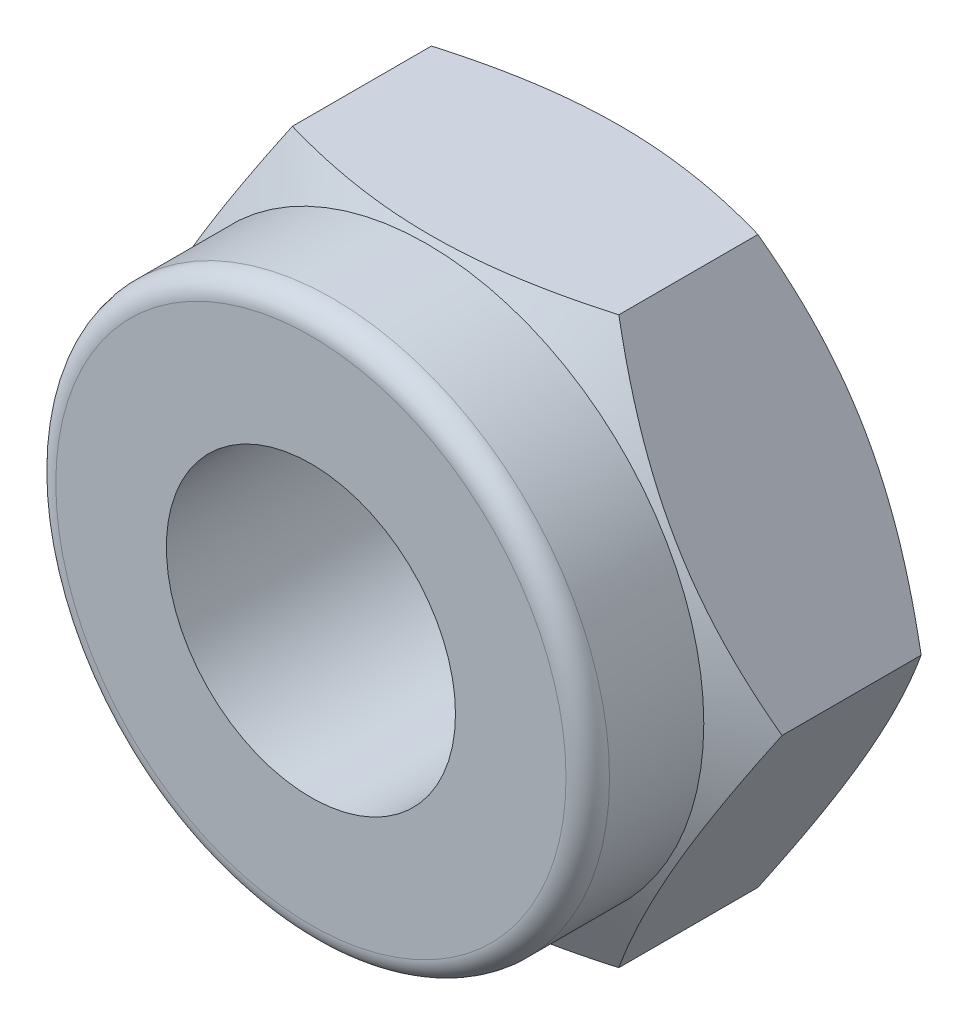
ISO-10303-21;
HEADER;
FILE_DESCRIPTION(('STEP AP214'),'2;1');
FILE_NAME('part.step','',(''),(''),'','','');
FILE_SCHEMA(('AUTOMOTIVE_DESIGN { 1 0 10303 214 1 1 1 1 }'));
ENDSEC;
DATA;
#1=APPLICATION_CONTEXT('core data for automotive mechanical design processes');
#2=APPLICATION_PROTOCOL_DEFINITION('international standard','automotive_design',2000,#1);
#3=PRODUCT_CONTEXT('',#1,'mechanical');
#4=PRODUCT('Part','Part','',(#3));
#5=PRODUCT_RELATED_PRODUCT_CATEGORY('part','',(#4));
#6=PRODUCT_DEFINITION_FORMATION('','',#4);
#7=PRODUCT_DEFINITION_CONTEXT('part definition',#1,'design');
#8=PRODUCT_DEFINITION('design','',#6,#7);
#9=PRODUCT_DEFINITION_SHAPE('','',#8);
#10=(LENGTH_UNIT() NAMED_UNIT(*) SI_UNIT(.MILLI.,.METRE.));
#11=(NAMED_UNIT(*) PLANE_ANGLE_UNIT() SI_UNIT($,.RADIAN.));
#12=(NAMED_UNIT(*) SI_UNIT($,.STERADIAN.) SOLID_ANGLE_UNIT());
#13=UNCERTAINTY_MEASURE_WITH_UNIT(LENGTH_MEASURE(1.E-05),#10,'distance_accuracy_value','');
#14=(GEOMETRIC_REPRESENTATION_CONTEXT(3) GLOBAL_UNCERTAINTY_ASSIGNED_CONTEXT((#13)) GLOBAL_UNIT_ASSIGNED_CONTEXT((#10,
#11,#12)) REPRESENTATION_CONTEXT('',''));
#15=CARTESIAN_POINT('',(0.,0.,0.));
#16=DIRECTION('',(0.,0.,1.));
#17=DIRECTION('',(1.,0.,0.));
#18=AXIS2_PLACEMENT_3D('',#15,#16,#17);
#19=CARTESIAN_POINT('',(0.,0.,4.35));
#20=DIRECTION('',(0.,0.,-1.));
#21=DIRECTION('',(-1.,0.,0.));
#22=AXIS2_PLACEMENT_3D('',#19,#20,#21);
#23=CYLINDRICAL_SURFACE('',#22,6.365);
#24=CARTESIAN_POINT('',(0.,0.,1.85));
#25=DIRECTION('',(0.,0.,1.));
#26=DIRECTION('',(1.,0.,0.));
#27=AXIS2_PLACEMENT_3D('',#24,#25,#26);
#28=CIRCLE('',#27,6.365);
#29=CARTESIAN_POINT('',(6.365,0.,1.85));
#30=VERTEX_POINT('',#29);
#31=EDGE_CURVE('E184',#30,#30,#28,.T.);
#32=ORIENTED_EDGE('',*,*,#31,.F.);
#33=EDGE_LOOP('',(#32));
#34=FACE_BOUND('',#33,.T.);
#35=CARTESIAN_POINT('',(0.,0.,-0.317542648054294));
#36=DIRECTION('',(0.,0.,-1.));
#37=DIRECTION('',(1.,0.,0.));
#38=AXIS2_PLACEMENT_3D('',#35,#36,#37);
#39=CIRCLE('',#38,6.365);
#40=CARTESIAN_POINT('',(6.365,0.,-0.317542648054294));
#41=VERTEX_POINT('',#40);
#42=EDGE_CURVE('E187',#41,#41,#39,.T.);
#43=ORIENTED_EDGE('',*,*,#42,.F.);
#44=EDGE_LOOP('',(#43));
#45=FACE_BOUND('',#44,.T.);
#46=ADVANCED_FACE('F16',(#34,#45),#23,.T.);
#47=CARTESIAN_POINT('',(0.,0.,1.85));
#48=DIRECTION('',(0.,0.,1.));
#49=DIRECTION('',(1.,0.,0.));
#50=AXIS2_PLACEMENT_3D('',#47,#48,#49);
#51=TOROIDAL_SURFACE('',#50,5.865,0.5);
#52=ORIENTED_EDGE('',*,*,#31,.T.);
#53=EDGE_LOOP('',(#52));
#54=FACE_BOUND('',#53,.T.);
#55=CARTESIAN_POINT('',(0.,0.,2.35));
#56=DIRECTION('',(0.,0.,-1.));
#57=DIRECTION('',(1.,0.,0.));
#58=AXIS2_PLACEMENT_3D('',#55,#56,#57);
#59=CIRCLE('',#58,5.865);
#60=CARTESIAN_POINT('',(-5.865,0.,2.35));
#61=VERTEX_POINT('',#60);
#62=CARTESIAN_POINT('',(5.865,0.,2.35));
#63=VERTEX_POINT('',#62);
#64=EDGE_CURVE('E74',#61,#63,#59,.F.);
#65=ORIENTED_EDGE('',*,*,#64,.F.);
#66=CARTESIAN_POINT('',(0.,0.,2.35));
#67=DIRECTION('',(0.,0.,-1.));
#68=DIRECTION('',(-1.,0.,0.));
#69=AXIS2_PLACEMENT_3D('',#66,#67,#68);
#70=CIRCLE('',#69,5.865);
#71=EDGE_CURVE('E190',#63,#61,#70,.F.);
#72=ORIENTED_EDGE('',*,*,#71,.F.);
#73=EDGE_LOOP('',(#65,#72));
#74=FACE_BOUND('',#73,.T.);
#75=ADVANCED_FACE('F107',(#54,#74),#51,.T.);
#76=CARTESIAN_POINT('',(0.,0.,-0.97999251121531));
#77=DIRECTION('',(0.,0.,-1.));
#78=DIRECTION('',(-1.,0.,0.));
#79=AXIS2_PLACEMENT_3D('',#76,#77,#78);
#80=CONICAL_SURFACE('',#79,7.51239682046193,1.0471975511966);
#81=CARTESIAN_POINT('',(7.50555349946514,0.,-0.976041517995662));
#82=CARTESIAN_POINT('',(7.42306413225731,-0.142875775088176,-0.928425447547227));
#83=CARTESIAN_POINT('',(7.34026720585395,-0.286284258329331,-0.882970550055043));
#84=CARTESIAN_POINT('',(7.17400096468323,-0.574265835620523,-0.796978304075957));
#85=CARTESIAN_POINT('',(7.09053137629194,-0.718839403601101,-0.756443076940983));
#86=CARTESIAN_POINT('',(6.83878625276799,-1.15487474810228,-0.643012619628592));
#87=CARTESIAN_POINT('',(6.66951702604567,-1.44805764894324,-0.578495682867198));
#88=CARTESIAN_POINT('',(6.41620872846852,-1.88680049032564,-0.502843782974544));
#89=CARTESIAN_POINT('',(6.33292644227507,-2.03104964138317,-0.48129310542054));
#90=CARTESIAN_POINT('',(6.16598561364301,-2.32019963843156,-0.445156633633839));
#91=CARTESIAN_POINT('',(6.08232710510691,-2.46510042570152,-0.430570224040223));
#92=CARTESIAN_POINT('',(5.91486483881928,-2.75515357926232,-0.408734025939752));
#93=CARTESIAN_POINT('',(5.83106135447214,-2.90030547200287,-0.401475912268133));
#94=CARTESIAN_POINT('',(5.66338165892069,-3.19073522409566,-0.394444145267347));
#95=CARTESIAN_POINT('',(5.57950545004408,-3.33601307941621,-0.394670260634795));
#96=CARTESIAN_POINT('',(5.34972638911939,-3.73400208745323,-0.405576488157031));
#97=CARTESIAN_POINT('',(5.20389879784904,-3.98658288467888,-0.423875958247116));
#98=CARTESIAN_POINT('',(4.91321216353889,-4.49006690438526,-0.481897477157326));
#99=CARTESIAN_POINT('',(4.76835414237743,-4.74096835692078,-0.521639346886367));
#100=CARTESIAN_POINT('',(4.47708276744823,-5.24546517708861,-0.620980029139186));
#101=CARTESIAN_POINT('',(4.33070615631823,-5.49899690460551,-0.680999630839513));
#102=CARTESIAN_POINT('',(4.04013550251678,-6.00228004017814,-0.817218966611441));
#103=CARTESIAN_POINT('',(3.89593774018532,-6.25203789087397,-0.893386714735364));
#104=CARTESIAN_POINT('',(3.75277674973258,-6.5,-0.976041517995661));
#105=B_SPLINE_CURVE_WITH_KNOTS('',3,(#81,#82,#83,#84,#85,#86,#87,#88,#89,#90,#91,#92,#93,#94,
#95,#96,#97,#98,#99,#100,#101,#102,#103,#104),.UNSPECIFIED.,.F.,.F.,(4,2,2,2,2,2,2,2,2,2,2,4),
(0.,0.515097151807923,1.03041562924707,2.0631934970254,2.56693469263121,3.07063136955385,
3.57375518587235,4.07686345294286,4.95263085757859,5.82920919385675,6.72522583711309,
7.61948397794854),.UNSPECIFIED.);
#106=CARTESIAN_POINT('',(7.50555349946513,0.,-0.976041517995657));
#107=VERTEX_POINT('',#106);
#108=CARTESIAN_POINT('',(3.75277674973258,-6.5,-0.976041517995662));
#109=VERTEX_POINT('',#108);
#110=EDGE_CURVE('E63',#107,#109,#105,.T.);
#111=ORIENTED_EDGE('',*,*,#110,.F.);
#112=CARTESIAN_POINT('',(3.75277674973256,6.5,-0.976041517995656));
#113=CARTESIAN_POINT('',(3.83526611694039,6.35712422491183,-0.928425447547222));
#114=CARTESIAN_POINT('',(3.91806304334374,6.21371574167068,-0.882970550055038));
#115=CARTESIAN_POINT('',(4.08432928451447,5.92573416437948,-0.796978304075951));
#116=CARTESIAN_POINT('',(4.16779887290576,5.78116059639891,-0.756443076940976));
#117=CARTESIAN_POINT('',(4.4195439964297,5.34512525189773,-0.643012619628585));
#118=CARTESIAN_POINT('',(4.58881322315202,5.05194235105677,-0.57849568286719));
#119=CARTESIAN_POINT('',(4.84212152072918,4.61319950967437,-0.502843782974536));
#120=CARTESIAN_POINT('',(4.92540380692262,4.46895035861684,-0.481293105420532));
#121=CARTESIAN_POINT('',(5.09234463555468,4.17980036156845,-0.445156633633831));
#122=CARTESIAN_POINT('',(5.17600314409078,4.03489957429849,-0.430570224040214));
#123=CARTESIAN_POINT('',(5.34346541037841,3.74484642073769,-0.408734025939743));
#124=CARTESIAN_POINT('',(5.42726889472555,3.59969452799714,-0.401475912268124));
#125=CARTESIAN_POINT('',(5.594948590277,3.30926477590435,-0.394444145267338));
#126=CARTESIAN_POINT('',(5.67882479915361,3.16398692058381,-0.394670260634785));
#127=CARTESIAN_POINT('',(5.9086038600783,2.76599791254678,-0.40557648815702));
#128=CARTESIAN_POINT('',(6.05443145134866,2.51341711532113,-0.423875958247104));
#129=CARTESIAN_POINT('',(6.34511808565881,2.00993309561475,-0.481897477157315));
#130=CARTESIAN_POINT('',(6.48997610682026,1.75903164307923,-0.521639346886356));
#131=CARTESIAN_POINT('',(6.78124748174947,1.25453482291139,-0.620980029139175));
#132=CARTESIAN_POINT('',(6.92762409287947,1.00100309539449,-0.680999630839503));
#133=CARTESIAN_POINT('',(7.21819474668093,0.497719959821852,-0.817218966611432));
#134=CARTESIAN_POINT('',(7.36239250901238,0.247962109126026,-0.893386714735356));
#135=CARTESIAN_POINT('',(7.50555349946513,0.,-0.976041517995654));
#136=B_SPLINE_CURVE_WITH_KNOTS('',3,(#112,#113,#114,#115,#116,#117,#118,#119,#120,#121,#122,
#123,#124,#125,#126,#127,#128,#129,#130,#131,#132,#133,#134,#135),.UNSPECIFIED.,.F.,.F.,(4,2,2,
2,2,2,2,2,2,2,2,4),(0.,0.515097151807923,1.03041562924707,2.06319349702539,2.5669346926312,
3.07063136955385,3.57375518587234,4.07686345294285,4.95263085757859,5.82920919385676,
6.72522583711311,7.61948397794856),.UNSPECIFIED.);
#137=CARTESIAN_POINT('',(3.75277674973256,6.5,-0.976041517995657));
#138=VERTEX_POINT('',#137);
#139=EDGE_CURVE('E68',#138,#107,#136,.T.);
#140=ORIENTED_EDGE('',*,*,#139,.F.);
#141=CARTESIAN_POINT('',(-3.75277674973256,6.5,-0.976041517995659));
#142=CARTESIAN_POINT('',(-3.5877980153169,6.5,-0.928425447547224));
#143=CARTESIAN_POINT('',(-3.42220416251019,6.5,-0.882970550055041));
#144=CARTESIAN_POINT('',(-3.08967168016874,6.5,-0.796978304075955));
#145=CARTESIAN_POINT('',(-2.92273250338616,6.5,-0.75644307694098));
#146=CARTESIAN_POINT('',(-2.41924225633827,6.5,-0.64301261962859));
#147=CARTESIAN_POINT('',(-2.08070380289362,6.5,-0.578495682867194));
#148=CARTESIAN_POINT('',(-1.57408720773932,6.5,-0.502843782974541));
#149=CARTESIAN_POINT('',(-1.40752263535244,6.5,-0.481293105420537));
#150=CARTESIAN_POINT('',(-1.07364097808831,6.5,-0.445156633633837));
#151=CARTESIAN_POINT('',(-0.906323961016103,6.5,-0.43057022404022));
#152=CARTESIAN_POINT('',(-0.57139942844085,6.5,-0.408734025939749));
#153=CARTESIAN_POINT('',(-0.40379245974657,6.5,-0.40147591226813));
#154=CARTESIAN_POINT('',(-0.0684330686436741,6.5,-0.394444145267344));
#155=CARTESIAN_POINT('',(0.0993193491095459,6.5,-0.394670260634792));
#156=CARTESIAN_POINT('',(0.558877470958923,6.5,-0.405576488157028));
#157=CARTESIAN_POINT('',(0.850532653499638,6.5,-0.423875958247112));
#158=CARTESIAN_POINT('',(1.43190592211994,6.5,-0.481897477157322));
#159=CARTESIAN_POINT('',(1.72162196444284,6.5,-0.521639346886363));
#160=CARTESIAN_POINT('',(2.30416471430125,6.5,-0.620980029139182));
#161=CARTESIAN_POINT('',(2.59691793656125,6.5,-0.680999630839509));
#162=CARTESIAN_POINT('',(3.17805924416416,6.5,-0.817218966611437));
#163=CARTESIAN_POINT('',(3.46645476882707,6.5,-0.89338671473536));
#164=CARTESIAN_POINT('',(3.75277674973256,6.5,-0.976041517995657));
#165=B_SPLINE_CURVE_WITH_KNOTS('',3,(#141,#142,#143,#144,#145,#146,#147,#148,#149,#150,#151,
#152,#153,#154,#155,#156,#157,#158,#159,#160,#161,#162,#163,#164),.UNSPECIFIED.,.F.,.F.,(4,2,2,
2,2,2,2,2,2,2,2,4),(0.,0.515097151807923,1.03041562924707,2.06319349702539,2.56693469263121,
3.07063136955385,3.57375518587235,4.07686345294286,4.95263085757859,5.82920919385675,
6.72522583711309,7.61948397794854),.UNSPECIFIED.);
#166=CARTESIAN_POINT('',(-3.75277674973256,6.5,-0.976041517995659));
#167=VERTEX_POINT('',#166);
#168=EDGE_CURVE('E86',#167,#138,#165,.T.);
#169=ORIENTED_EDGE('',*,*,#168,.F.);
#170=CARTESIAN_POINT('',(-7.50555349946513,0.,-0.976041517995657));
#171=CARTESIAN_POINT('',(-7.4230641322573,0.14287577508817,-0.928425447547223));
#172=CARTESIAN_POINT('',(-7.34026720585394,0.286284258329325,-0.882970550055039));
#173=CARTESIAN_POINT('',(-7.17400096468322,0.574265835620517,-0.796978304075953));
#174=CARTESIAN_POINT('',(-7.09053137629193,0.718839403601094,-0.756443076940978));
#175=CARTESIAN_POINT('',(-6.83878625276799,1.15487474810227,-0.643012619628588));
#176=CARTESIAN_POINT('',(-6.66951702604566,1.44805764894323,-0.578495682867193));
#177=CARTESIAN_POINT('',(-6.41620872846851,1.88680049032563,-0.502843782974539));
#178=CARTESIAN_POINT('',(-6.33292644227507,2.03104964138316,-0.481293105420536));
#179=CARTESIAN_POINT('',(-6.165985613643,2.32019963843155,-0.445156633633835));
#180=CARTESIAN_POINT('',(-6.0823271051069,2.46510042570151,-0.430570224040218));
#181=CARTESIAN_POINT('',(-5.91486483881928,2.75515357926231,-0.408734025939748));
#182=CARTESIAN_POINT('',(-5.83106135447214,2.90030547200286,-0.401475912268128));
#183=CARTESIAN_POINT('',(-5.66338165892069,3.19073522409565,-0.394444145267342));
#184=CARTESIAN_POINT('',(-5.57950545004408,3.3360130794162,-0.394670260634789));
#185=CARTESIAN_POINT('',(-5.34972638911939,3.73400208745322,-0.405576488157025));
#186=CARTESIAN_POINT('',(-5.20389879784903,3.98658288467887,-0.42387595824711));
#187=CARTESIAN_POINT('',(-4.91321216353888,4.49006690438525,-0.481897477157321));
#188=CARTESIAN_POINT('',(-4.76835414237743,4.74096835692077,-0.521639346886362));
#189=CARTESIAN_POINT('',(-4.47708276744822,5.2454651770886,-0.620980029139181));
#190=CARTESIAN_POINT('',(-4.33070615631822,5.49899690460551,-0.680999630839509));
#191=CARTESIAN_POINT('',(-4.04013550251676,6.00228004017814,-0.817218966611438));
#192=CARTESIAN_POINT('',(-3.89593774018531,6.25203789087397,-0.893386714735362));
#193=CARTESIAN_POINT('',(-3.75277674973256,6.5,-0.976041517995659));
#194=B_SPLINE_CURVE_WITH_KNOTS('',3,(#170,#171,#172,#173,#174,#175,#176,#177,#178,#179,#180,
#181,#182,#183,#184,#185,#186,#187,#188,#189,#190,#191,#192,#193),.UNSPECIFIED.,.F.,.F.,(4,2,2,
2,2,2,2,2,2,2,2,4),(0.,0.515097151807923,1.03041562924707,2.06319349702539,2.56693469263121,
3.07063136955385,3.57375518587235,4.07686345294286,4.95263085757859,5.82920919385676,
6.7252258371131,7.61948397794855),.UNSPECIFIED.);
#195=CARTESIAN_POINT('',(-7.50555349946513,0.,-0.976041517995656));
#196=VERTEX_POINT('',#195);
#197=EDGE_CURVE('E233',#196,#167,#194,.T.);
#198=ORIENTED_EDGE('',*,*,#197,.F.);
#199=CARTESIAN_POINT('',(-3.75277674973256,-6.5,-0.976041517995658));
#200=CARTESIAN_POINT('',(-3.83526611694039,-6.35712422491183,-0.928425447547224));
#201=CARTESIAN_POINT('',(-3.91806304334374,-6.21371574167068,-0.88297055005504));
#202=CARTESIAN_POINT('',(-4.08432928451447,-5.92573416437949,-0.796978304075952));
#203=CARTESIAN_POINT('',(-4.16779887290576,-5.78116059639891,-0.756443076940977));
#204=CARTESIAN_POINT('',(-4.4195439964297,-5.34512525189773,-0.643012619628585));
#205=CARTESIAN_POINT('',(-4.58881322315203,-5.05194235105677,-0.578495682867191));
#206=CARTESIAN_POINT('',(-4.84212152072918,-4.61319950967437,-0.502843782974538));
#207=CARTESIAN_POINT('',(-4.92540380692262,-4.46895035861684,-0.481293105420534));
#208=CARTESIAN_POINT('',(-5.09234463555468,-4.17980036156845,-0.445156633633833));
#209=CARTESIAN_POINT('',(-5.17600314409079,-4.03489957429849,-0.430570224040216));
#210=CARTESIAN_POINT('',(-5.34346541037841,-3.74484642073769,-0.408734025939745));
#211=CARTESIAN_POINT('',(-5.42726889472555,-3.59969452799714,-0.401475912268125));
#212=CARTESIAN_POINT('',(-5.594948590277,-3.30926477590435,-0.394444145267339));
#213=CARTESIAN_POINT('',(-5.67882479915361,-3.1639869205838,-0.394670260634786));
#214=CARTESIAN_POINT('',(-5.9086038600783,-2.76599791254678,-0.405576488157022));
#215=CARTESIAN_POINT('',(-6.05443145134866,-2.51341711532113,-0.423875958247106));
#216=CARTESIAN_POINT('',(-6.34511808565881,-2.00993309561475,-0.481897477157316));
#217=CARTESIAN_POINT('',(-6.48997610682026,-1.75903164307923,-0.521639346886357));
#218=CARTESIAN_POINT('',(-6.78124748174947,-1.2545348229114,-0.620980029139176));
#219=CARTESIAN_POINT('',(-6.92762409287947,-1.00100309539449,-0.680999630839504));
#220=CARTESIAN_POINT('',(-7.21819474668093,-0.497719959821857,-0.817218966611433));
#221=CARTESIAN_POINT('',(-7.36239250901238,-0.247962109126032,-0.893386714735357));
#222=CARTESIAN_POINT('',(-7.50555349946513,0.,-0.976041517995654));
#223=B_SPLINE_CURVE_WITH_KNOTS('',3,(#199,#200,#201,#202,#203,#204,#205,#206,#207,#208,#209,
#210,#211,#212,#213,#214,#215,#216,#217,#218,#219,#220,#221,#222),.UNSPECIFIED.,.F.,.F.,(4,2,2,
2,2,2,2,2,2,2,2,4),(0.,0.515097151807923,1.03041562924707,2.06319349702539,2.56693469263121,
3.07063136955385,3.57375518587235,4.07686345294285,4.95263085757859,5.82920919385676,
6.7252258371131,7.61948397794856),.UNSPECIFIED.);
#224=CARTESIAN_POINT('',(-3.75277674973256,-6.5,-0.976041517995657));
#225=VERTEX_POINT('',#224);
#226=EDGE_CURVE('E117',#225,#196,#223,.T.);
#227=ORIENTED_EDGE('',*,*,#226,.F.);
#228=CARTESIAN_POINT('',(3.75277674973257,-6.5,-0.976041517995663));
#229=CARTESIAN_POINT('',(3.58779801531691,-6.5,-0.928425447547228));
#230=CARTESIAN_POINT('',(3.4222041625102,-6.5,-0.882970550055044));
#231=CARTESIAN_POINT('',(3.08967168016875,-6.5,-0.796978304075957));
#232=CARTESIAN_POINT('',(2.92273250338617,-6.5,-0.756443076940983));
#233=CARTESIAN_POINT('',(2.41924225633828,-6.5,-0.643012619628591));
#234=CARTESIAN_POINT('',(2.08070380289363,-6.5,-0.578495682867196));
#235=CARTESIAN_POINT('',(1.57408720773933,-6.5,-0.502843782974542));
#236=CARTESIAN_POINT('',(1.40752263535245,-6.5,-0.481293105420539));
#237=CARTESIAN_POINT('',(1.07364097808832,-6.5,-0.445156633633838));
#238=CARTESIAN_POINT('',(0.906323961016112,-6.5,-0.430570224040221));
#239=CARTESIAN_POINT('',(0.571399428440859,-6.5,-0.40873402593975));
#240=CARTESIAN_POINT('',(0.403792459746578,-6.5,-0.40147591226813));
#241=CARTESIAN_POINT('',(0.0684330686436822,-6.5,-0.394444145267344));
#242=CARTESIAN_POINT('',(-0.0993193491095378,-6.5,-0.394670260634792));
#243=CARTESIAN_POINT('',(-0.558877470958916,-6.5,-0.405576488157028));
#244=CARTESIAN_POINT('',(-0.850532653499632,-6.5,-0.423875958247112));
#245=CARTESIAN_POINT('',(-1.43190592211993,-6.5,-0.481897477157322));
#246=CARTESIAN_POINT('',(-1.72162196444284,-6.5,-0.521639346886363));
#247=CARTESIAN_POINT('',(-2.30416471430125,-6.5,-0.620980029139181));
#248=CARTESIAN_POINT('',(-2.59691793656124,-6.5,-0.680999630839508));
#249=CARTESIAN_POINT('',(-3.17805924416416,-6.5,-0.817218966611435));
#250=CARTESIAN_POINT('',(-3.46645476882707,-6.5,-0.893386714735359));
#251=CARTESIAN_POINT('',(-3.75277674973256,-6.5,-0.976041517995657));
#252=B_SPLINE_CURVE_WITH_KNOTS('',3,(#228,#229,#230,#231,#232,#233,#234,#235,#236,#237,#238,
#239,#240,#241,#242,#243,#244,#245,#246,#247,#248,#249,#250,#251),.UNSPECIFIED.,.F.,.F.,(4,2,2,
2,2,2,2,2,2,2,2,4),(0.,0.515097151807923,1.03041562924707,2.0631934970254,2.56693469263121,
3.07063136955385,3.57375518587235,4.07686345294286,4.95263085757859,5.82920919385676,
6.7252258371131,7.61948397794855),.UNSPECIFIED.);
#253=EDGE_CURVE('E71',#109,#225,#252,.T.);
#254=ORIENTED_EDGE('',*,*,#253,.F.);
#255=EDGE_LOOP('',(#111,#140,#169,#198,#227,#254));
#256=FACE_BOUND('',#255,.T.);
#257=ORIENTED_EDGE('',*,*,#42,.T.);
#258=EDGE_LOOP('',(#257));
#259=FACE_BOUND('',#258,.T.);
#260=ADVANCED_FACE('F64',(#256,#259),#80,.T.);
#261=CARTESIAN_POINT('',(0.,0.,2.35));
#262=DIRECTION('',(0.,0.,1.));
#263=DIRECTION('',(1.,0.,0.));
#264=AXIS2_PLACEMENT_3D('',#261,#262,#263);
#265=PLANE('',#264);
#266=CARTESIAN_POINT('',(0.,0.,2.35));
#267=DIRECTION('',(0.,0.,1.));
#268=DIRECTION('',(1.,0.,0.));
#269=AXIS2_PLACEMENT_3D('',#266,#267,#268);
#270=CIRCLE('',#269,3.3235);
#271=CARTESIAN_POINT('',(3.3235,0.,2.35));
#272=VERTEX_POINT('',#271);
#273=EDGE_CURVE('E81',#272,#272,#270,.F.);
#274=ORIENTED_EDGE('',*,*,#273,.T.);
#275=EDGE_LOOP('',(#274));
#276=FACE_BOUND('',#275,.T.);
#277=ORIENTED_EDGE('',*,*,#71,.T.);
#278=ORIENTED_EDGE('',*,*,#64,.T.);
#279=EDGE_LOOP('',(#277,#278));
#280=FACE_BOUND('',#279,.T.);
#281=ADVANCED_FACE('F106',(#276,#280),#265,.T.);
#282=CARTESIAN_POINT('',(3.75277674973258,-6.5,-5.15));
#283=DIRECTION('',(0.866025403784439,-0.5,0.));
#284=DIRECTION('',(0.5,0.866025403784439,0.));
#285=AXIS2_PLACEMENT_3D('',#282,#283,#284);
#286=PLANE('',#285);
#287=DIRECTION('',(0.,0.,-1.));
#288=VECTOR('',#287,1.);
#289=CARTESIAN_POINT('',(3.75277674973258,-6.5,-5.15));
#290=LINE('',#289,#288);
#291=CARTESIAN_POINT('',(3.75277676639756,-6.5,-4.17395847719851));
#292=VERTEX_POINT('',#291);
#293=EDGE_CURVE('E73',#292,#109,#290,.F.);
#294=ORIENTED_EDGE('',*,*,#293,.F.);
#295=CARTESIAN_POINT('',(7.5055534994611,-7.00308469126436E-12,-4.17395848201161));
#296=CARTESIAN_POINT('',(7.42306413226044,-0.142875775082739,-4.22157455245497));
#297=CARTESIAN_POINT('',(7.34026720586433,-0.286284258311354,-4.26702944994249));
#298=CARTESIAN_POINT('',(7.17400096470823,-0.574265835577209,-4.35302169591321));
#299=CARTESIAN_POINT('',(7.09053137632433,-0.71883940354499,-4.39355692304449));
#300=CARTESIAN_POINT('',(6.83878625282459,-1.15487474800424,-4.50698738034673));
#301=CARTESIAN_POINT('',(6.66951702611933,-1.44805764881566,-4.57150431710366));
#302=CARTESIAN_POINT('',(6.4162087285524,-1.88680049018035,-4.64715621699928));
#303=CARTESIAN_POINT('',(6.33292644235192,-2.03104964125008,-4.66870689455695));
#304=CARTESIAN_POINT('',(6.16598561370569,-2.320199638323,-4.70484336634996));
#305=CARTESIAN_POINT('',(6.08232710516246,-2.46510042560531,-4.71942977594624));
#306=CARTESIAN_POINT('',(5.91486483885972,-2.75515357919228,-4.7412659740512));
#307=CARTESIAN_POINT('',(5.83106135450459,-2.90030547194666,-4.74852408772457));
#308=CARTESIAN_POINT('',(5.66338165893724,-3.190735224067,-4.75555585472706));
#309=CARTESIAN_POINT('',(5.57950545005271,-3.33601307940126,-4.75532973935959));
#310=CARTESIAN_POINT('',(5.34972639277594,-3.73400208111991,-4.74442351201218));
#311=CARTESIAN_POINT('',(5.20389880515664,-3.98658287202175,-4.72612404266922));
#312=CARTESIAN_POINT('',(4.91321217808701,-4.49006687918717,-4.66810252628159));
#313=CARTESIAN_POINT('',(4.76835416051488,-4.7409683255058,-4.62836065833044));
#314=CARTESIAN_POINT('',(4.47708279284768,-5.24546513309547,-4.52901998051057));
#315=CARTESIAN_POINT('',(4.33070618538681,-5.49899685425726,-4.4690003814974));
#316=CARTESIAN_POINT('',(4.04013553879003,-6.00227997735102,-4.33278105168422));
#317=CARTESIAN_POINT('',(3.89593777999461,-6.25203782192225,-4.25661330682833));
#318=CARTESIAN_POINT('',(3.75277679302817,-6.49999992500984,-4.173958507006));
#319=B_SPLINE_CURVE_WITH_KNOTS('',3,(#295,#296,#297,#298,#299,#300,#301,#302,#303,#304,#305,
#306,#307,#308,#309,#310,#311,#312,#313,#314,#315,#316,#317,#318),.UNSPECIFIED.,.F.,.F.,(4,2,2,
2,2,2,2,2,2,2,2,4),(0.,0.515097151762339,1.03041562915581,2.06319349683153,2.56693469248062,
3.07063136944647,3.5737551858133,4.07686345293021,4.95263083563277,5.82920914989659,
6.72522576999469,7.6194838878483),.UNSPECIFIED.);
#320=CARTESIAN_POINT('',(7.50555349949747,0.,-4.17395848200038));
#321=VERTEX_POINT('',#320);
#322=EDGE_CURVE('E35',#321,#292,#319,.T.);
#323=ORIENTED_EDGE('',*,*,#322,.F.);
#324=DIRECTION('',(0.,0.,1.));
#325=VECTOR('',#324,1.);
#326=CARTESIAN_POINT('',(7.50555349946513,0.,-5.15));
#327=LINE('',#326,#325);
#328=EDGE_CURVE('E76',#107,#321,#327,.F.);
#329=ORIENTED_EDGE('',*,*,#328,.F.);
#330=ORIENTED_EDGE('',*,*,#110,.T.);
#331=EDGE_LOOP('',(#294,#323,#329,#330));
#332=FACE_BOUND('',#331,.T.);
#333=ADVANCED_FACE('F77',(#332),#286,.T.);
#334=CARTESIAN_POINT('',(-3.75277674973256,-6.5,-5.15));
#335=DIRECTION('',(0.,-1.,0.));
#336=DIRECTION('',(0.,0.,-1.));
#337=AXIS2_PLACEMENT_3D('',#334,#335,#336);
#338=PLANE('',#337);
#339=DIRECTION('',(0.,0.,1.));
#340=VECTOR('',#339,1.);
#341=CARTESIAN_POINT('',(-3.75277674973256,-6.5,-5.15));
#342=LINE('',#341,#340);
#343=CARTESIAN_POINT('',(-3.75277674139978,-6.5000000144328,-4.17395847719835));
#344=VERTEX_POINT('',#343);
#345=EDGE_CURVE('E131',#344,#225,#342,.T.);
#346=ORIENTED_EDGE('',*,*,#345,.F.);
#347=CARTESIAN_POINT('',(3.75277678306254,-6.5,-4.17395847238775));
#348=CARTESIAN_POINT('',(3.58779804838594,-6.5,-4.22157454322773));
#349=CARTESIAN_POINT('',(3.42220419531707,-6.5,-4.26702944112164));
#350=CARTESIAN_POINT('',(3.08967171244588,-6.5,-4.3530216879232));
#351=CARTESIAN_POINT('',(2.92273253539569,-6.5,-4.39355691547892));
#352=CARTESIAN_POINT('',(2.41924228751765,-6.5,-4.5069873740845));
#353=CARTESIAN_POINT('',(2.08070383349787,-6.5,-4.57150431174356));
#354=CARTESIAN_POINT('',(1.57408723743433,-6.5,-4.64715621298692));
#355=CARTESIAN_POINT('',(1.40752266473778,-6.5,-4.6687068909864));
#356=CARTESIAN_POINT('',(1.07364100683674,-6.5,-4.70484336365841));
#357=CARTESIAN_POINT('',(0.906323989437311,-6.5,-4.71942977369187));
#358=CARTESIAN_POINT('',(0.571399456190159,-6.5,-4.74126597265532));
#359=CARTESIAN_POINT('',(0.403792487151232,-6.5,-4.74852408675015));
#360=CARTESIAN_POINT('',(0.0684330953407197,-6.5,-4.75555585456964));
#361=CARTESIAN_POINT('',(-0.0993193227754698,-6.5,-4.75532973959772));
#362=CARTESIAN_POINT('',(-0.558877439803717,-6.5,-4.74442351324807));
#363=CARTESIAN_POINT('',(-0.850532617185107,-6.5,-4.72612404435291));
#364=CARTESIAN_POINT('',(-1.43190587561644,-6.5,-4.66810252850229));
#365=CARTESIAN_POINT('',(-1.72162191290994,-6.5,-4.62836066063956));
#366=CARTESIAN_POINT('',(-2.30416465261939,-6.5,-4.5290199826661));
#367=CARTESIAN_POINT('',(-2.59691786976532,-6.5,-4.46900038339938));
#368=CARTESIAN_POINT('',(-3.17805916733875,-6.5,-4.33278105281471));
#369=CARTESIAN_POINT('',(-3.46645468708551,-6.5,-4.25661330744193));
#370=CARTESIAN_POINT('',(-3.75277666314028,-6.5,-4.17395850700632));
#371=B_SPLINE_CURVE_WITH_KNOTS('',3,(#347,#348,#349,#350,#351,#352,#353,#354,#355,#356,#357,
#358,#359,#360,#361,#362,#363,#364,#365,#366,#367,#368,#369,#370),.UNSPECIFIED.,.F.,.F.,(4,2,2,
2,2,2,2,2,2,2,2,4),(0.,0.515097152885971,1.03041563140371,2.06319350138647,2.56693469808512,
3.07063137610016,3.57375519350606,4.07686346166217,4.95263085067335,5.82920917127014,
6.72522579804451,7.61948392253173),.UNSPECIFIED.);
#372=EDGE_CURVE('E142',#292,#344,#371,.T.);
#373=ORIENTED_EDGE('',*,*,#372,.F.);
#374=ORIENTED_EDGE('',*,*,#293,.T.);
#375=ORIENTED_EDGE('',*,*,#253,.T.);
#376=EDGE_LOOP('',(#346,#373,#374,#375));
#377=FACE_BOUND('',#376,.T.);
#378=ADVANCED_FACE('F132',(#377),#338,.T.);
#379=CARTESIAN_POINT('',(-7.50555349946513,0.,-5.15));
#380=DIRECTION('',(-0.866025403784439,-0.5,0.));
#381=DIRECTION('',(0.5,-0.866025403784439,0.));
#382=AXIS2_PLACEMENT_3D('',#379,#380,#381);
#383=PLANE('',#382);
#384=DIRECTION('',(0.,0.,1.));
#385=VECTOR('',#384,1.);
#386=CARTESIAN_POINT('',(-7.50555349946513,0.,-5.15));
#387=LINE('',#386,#385);
#388=CARTESIAN_POINT('',(-7.50555349943801,0.,-4.17395848203379));
#389=VERTEX_POINT('',#388);
#390=EDGE_CURVE('E230',#389,#196,#387,.T.);
#391=ORIENTED_EDGE('',*,*,#390,.F.);
#392=CARTESIAN_POINT('',(-3.752776733067,-6.5000000288656,-4.17395847238742));
#393=CARTESIAN_POINT('',(-3.83526610041231,-6.3571242535393,-4.22157454323146));
#394=CARTESIAN_POINT('',(-3.91806302695381,-6.21371577005887,-4.26702944112906));
#395=CARTESIAN_POINT('',(-4.08432926840367,-5.9257341922842,-4.35302168793712));
#396=CARTESIAN_POINT('',(-4.16779885693595,-5.78116062405942,-4.39355691549566));
#397=CARTESIAN_POINT('',(-4.41954398089852,-5.34512527879852,-4.5069873741089));
#398=CARTESIAN_POINT('',(-4.58881320792497,-5.0519423774308,-4.57150431177098));
#399=CARTESIAN_POINT('',(-4.84212150596625,-4.61319953524451,-4.64715621300974));
#400=CARTESIAN_POINT('',(-4.9254037923073,-4.46895038393132,-4.6687068910051));
#401=CARTESIAN_POINT('',(-5.09234462124325,-4.17980038635659,-4.70484336367005));
#402=CARTESIAN_POINT('',(-5.17600312993563,-4.03489959881594,-4.71942977370055));
#403=CARTESIAN_POINT('',(-5.34346539654368,-3.74484644470016,-4.74126597265909));
#404=CARTESIAN_POINT('',(-5.42726888105494,-3.59969455167533,-4.74852408675204));
#405=CARTESIAN_POINT('',(-5.59494857694387,-3.30926479899802,-4.75555585456974));
#406=CARTESIAN_POINT('',(-5.67882478599383,-3.16398694337721,-4.75532973959787));
#407=CARTESIAN_POINT('',(-5.90860384815547,-2.76599793319772,-4.74442351307375));
#408=CARTESIAN_POINT('',(-6.05443144049704,-2.51341713411668,-4.72612404343191));
#409=CARTESIAN_POINT('',(-6.3451180769529,-2.00993311069382,-4.66810252506002));
#410=CARTESIAN_POINT('',(-6.48997609918883,-1.75903165629725,-4.62836065542026));
#411=CARTESIAN_POINT('',(-6.78124747630522,-1.25453483234112,-4.52901997301599));
#412=CARTESIAN_POINT('',(-6.92762408854711,-1.00100310289835,-4.46900037106339));
#413=CARTESIAN_POINT('',(-7.21819474453819,-0.497719963533187,-4.3327810345228));
#414=CARTESIAN_POINT('',(-7.36239250794748,-0.247962110970489,-4.25661328588355));
#415=CARTESIAN_POINT('',(-7.50555349946109,-6.99262702393653E-12,-4.17395848201162));
#416=B_SPLINE_CURVE_WITH_KNOTS('',3,(#392,#393,#394,#395,#396,#397,#398,#399,#400,#401,#402,
#403,#404,#405,#406,#407,#408,#409,#410,#411,#412,#413,#414,#415),.UNSPECIFIED.,.F.,.F.,(4,2,2,
2,2,2,2,2,2,2,2,4),(0.,0.515097152929786,1.03041563149142,2.06319350157311,2.56693469822717,
3.0706313761977,3.57375519355399,4.07686346166242,4.95263087260564,5.8292092152156,
6.72522586514627,7.61948401261348),.UNSPECIFIED.);
#417=EDGE_CURVE('E149',#344,#389,#416,.T.);
#418=ORIENTED_EDGE('',*,*,#417,.F.);
#419=ORIENTED_EDGE('',*,*,#345,.T.);
#420=ORIENTED_EDGE('',*,*,#226,.T.);
#421=EDGE_LOOP('',(#391,#418,#419,#420));
#422=FACE_BOUND('',#421,.T.);
#423=ADVANCED_FACE('F135',(#422),#383,.T.);
#424=CARTESIAN_POINT('',(-3.75277674973256,6.5,-5.15));
#425=DIRECTION('',(-0.866025403784439,0.5,0.));
#426=DIRECTION('',(-0.5,-0.866025403784439,0.));
#427=AXIS2_PLACEMENT_3D('',#424,#425,#426);
#428=PLANE('',#427);
#429=DIRECTION('',(0.,0.,1.));
#430=VECTOR('',#429,1.);
#431=CARTESIAN_POINT('',(-3.75277674973256,6.5,-5.15));
#432=LINE('',#431,#430);
#433=CARTESIAN_POINT('',(-3.75277676638744,6.5,-4.17395847720143));
#434=VERTEX_POINT('',#433);
#435=EDGE_CURVE('E234',#434,#167,#432,.T.);
#436=ORIENTED_EDGE('',*,*,#435,.F.);
#437=CARTESIAN_POINT('',(-7.50555349946109,6.99792653970339E-12,-4.17395848201161));
#438=CARTESIAN_POINT('',(-7.42306413226044,0.14287577508273,-4.22157455245498));
#439=CARTESIAN_POINT('',(-7.34026720586433,0.286284258311341,-4.26702944994249));
#440=CARTESIAN_POINT('',(-7.17400096470824,0.574265835577188,-4.35302169591321));
#441=CARTESIAN_POINT('',(-7.09053137632434,0.718839403544965,-4.39355692304449));
#442=CARTESIAN_POINT('',(-6.8387862528246,1.15487474800421,-4.50698738034673));
#443=CARTESIAN_POINT('',(-6.66951702611934,1.44805764881561,-4.57150431710366));
#444=CARTESIAN_POINT('',(-6.41620872855242,1.8868004901803,-4.64715621699928));
#445=CARTESIAN_POINT('',(-6.33292644235194,2.03104964125003,-4.66870689455695));
#446=CARTESIAN_POINT('',(-6.1659856137057,2.32019963832296,-4.70484336634997));
#447=CARTESIAN_POINT('',(-6.08232710516247,2.46510042560527,-4.71942977594624));
#448=CARTESIAN_POINT('',(-5.91486483885972,2.75515357919225,-4.7412659740512));
#449=CARTESIAN_POINT('',(-5.8310613545046,2.90030547194664,-4.74852408772457));
#450=CARTESIAN_POINT('',(-5.66338165893724,3.19073522406698,-4.75555585472706));
#451=CARTESIAN_POINT('',(-5.57950545005271,3.33601307940125,-4.7553297393596));
#452=CARTESIAN_POINT('',(-5.349726392777,3.73400208111806,-4.74442351201223));
#453=CARTESIAN_POINT('',(-5.20389880515875,3.98658287201807,-4.72612404266949));
#454=CARTESIAN_POINT('',(-4.91321217809122,4.49006687917986,-4.66810252628259));
#455=CARTESIAN_POINT('',(-4.76835416052013,4.74096832549669,-4.62836065833196));
#456=CARTESIAN_POINT('',(-4.47708279285504,5.2454651330827,-4.52901998051337));
#457=CARTESIAN_POINT('',(-4.33070618539523,5.49899685424265,-4.46900038150099));
#458=CARTESIAN_POINT('',(-4.04013553880054,6.0022799773328,-4.33278105168953));
#459=CARTESIAN_POINT('',(-3.89593778000614,6.25203782190225,-4.25661330683458));
#460=CARTESIAN_POINT('',(-3.75277679304071,6.49999992498809,-4.17395850701325));
#461=B_SPLINE_CURVE_WITH_KNOTS('',3,(#437,#438,#439,#440,#441,#442,#443,#444,#445,#446,#447,
#448,#449,#450,#451,#452,#453,#454,#455,#456,#457,#458,#459,#460),.UNSPECIFIED.,.F.,.F.,(4,2,2,
2,2,2,2,2,2,2,2,4),(0.,0.515097151762326,1.03041562915578,2.06319349683147,2.56693469248058,
3.07063136944643,3.57375518581328,4.0768634529302,4.95263083562641,5.82920914988384,
6.72522576997523,7.61948388782218),.UNSPECIFIED.);
#462=EDGE_CURVE('E406',#389,#434,#461,.T.);
#463=ORIENTED_EDGE('',*,*,#462,.F.);
#464=ORIENTED_EDGE('',*,*,#390,.T.);
#465=ORIENTED_EDGE('',*,*,#197,.T.);
#466=EDGE_LOOP('',(#436,#463,#464,#465));
#467=FACE_BOUND('',#466,.T.);
#468=ADVANCED_FACE('F295',(#467),#428,.T.);
#469=CARTESIAN_POINT('',(3.75277674973256,6.5,-5.15));
#470=DIRECTION('',(0.,1.,0.));
#471=DIRECTION('',(0.,0.,1.));
#472=AXIS2_PLACEMENT_3D('',#469,#470,#471);
#473=PLANE('',#472);
#474=DIRECTION('',(0.,0.,1.));
#475=VECTOR('',#474,1.);
#476=CARTESIAN_POINT('',(3.75277674973256,6.5,-5.15));
#477=LINE('',#476,#475);
#478=CARTESIAN_POINT('',(3.752776741409,6.50000001441682,-4.17395847720368));
#479=VERTEX_POINT('',#478);
#480=EDGE_CURVE('E84',#479,#138,#477,.T.);
#481=ORIENTED_EDGE('',*,*,#480,.F.);
#482=CARTESIAN_POINT('',(-3.75277678304232,6.5,-4.17395847239358));
#483=CARTESIAN_POINT('',(-3.58779804836589,6.5,-4.22157454323333));
#484=CARTESIAN_POINT('',(-3.42220419529719,6.5,-4.26702944112699));
#485=CARTESIAN_POINT('',(-3.08967171242633,6.5,-4.35302168792804));
#486=CARTESIAN_POINT('',(-2.92273253537632,6.5,-4.39355691548351));
#487=CARTESIAN_POINT('',(-2.41924228749882,6.5,-4.50698737408829));
#488=CARTESIAN_POINT('',(-2.08070383347942,6.5,-4.5715043117468));
#489=CARTESIAN_POINT('',(-1.57408723741644,6.5,-4.64715621298935));
#490=CARTESIAN_POINT('',(-1.40752266472006,6.5,-4.66870689098856));
#491=CARTESIAN_POINT('',(-1.07364100681939,6.5,-4.70484336366004));
#492=CARTESIAN_POINT('',(-0.906323989420151,6.5,-4.71942977369324));
#493=CARTESIAN_POINT('',(-0.571399456173385,6.5,-4.74126597265617));
#494=CARTESIAN_POINT('',(-0.403792487134656,6.5,-4.74852408675074));
#495=CARTESIAN_POINT('',(-0.0684330953245501,6.5,-4.75555585456974));
#496=CARTESIAN_POINT('',(0.0993193227914305,6.5,-4.75532973959757));
#497=CARTESIAN_POINT('',(0.558877439817462,6.5,-4.74442351324734));
#498=CARTESIAN_POINT('',(0.850532617196836,6.5,-4.72612404435198));
#499=CARTESIAN_POINT('',(1.43190587562414,6.5,-4.66810252850128));
#500=CARTESIAN_POINT('',(1.72162191291564,6.5,-4.62836066063867));
#501=CARTESIAN_POINT('',(2.30416465262101,6.5,-4.52901998266574));
#502=CARTESIAN_POINT('',(2.59691786976487,6.5,-4.46900038339944));
#503=CARTESIAN_POINT('',(3.17805916733423,6.5,-4.33278105281581));
#504=CARTESIAN_POINT('',(3.46645468707899,6.5,-4.25661330744367));
#505=CARTESIAN_POINT('',(3.75277666313179,6.5,-4.17395850700877));
#506=B_SPLINE_CURVE_WITH_KNOTS('',3,(#482,#483,#484,#485,#486,#487,#488,#489,#490,#491,#492,
#493,#494,#495,#496,#497,#498,#499,#500,#501,#502,#503,#504,#505),.UNSPECIFIED.,.F.,.F.,(4,2,2,
2,2,2,2,2,2,2,2,4),(0.,0.515097152885285,1.03041563140234,2.06319350138369,2.56693469808171,
3.07063137609611,3.57375519350139,4.07686346165687,4.95263085066208,5.82920917125287,
6.72522579802091,7.61948392250186),.UNSPECIFIED.);
#507=EDGE_CURVE('E168',#434,#479,#506,.T.);
#508=ORIENTED_EDGE('',*,*,#507,.F.);
#509=ORIENTED_EDGE('',*,*,#435,.T.);
#510=ORIENTED_EDGE('',*,*,#168,.T.);
#511=EDGE_LOOP('',(#481,#508,#509,#510));
#512=FACE_BOUND('',#511,.T.);
#513=ADVANCED_FACE('F287',(#512),#473,.T.);
#514=CARTESIAN_POINT('',(7.50555349946513,0.,-5.15));
#515=DIRECTION('',(0.866025403784439,0.5,0.));
#516=DIRECTION('',(-0.5,0.866025403784439,0.));
#517=AXIS2_PLACEMENT_3D('',#514,#515,#516);
#518=PLANE('',#517);
#519=ORIENTED_EDGE('',*,*,#328,.T.);
#520=CARTESIAN_POINT('',(3.75277673308544,6.50000002883365,-4.17395847239807));
#521=CARTESIAN_POINT('',(3.83526610043061,6.35712425350761,-4.22157454324168));
#522=CARTESIAN_POINT('',(3.91806302697195,6.21371577002745,-4.26702944113883));
#523=CARTESIAN_POINT('',(4.0843292684215,5.92573419225332,-4.35302168794597));
#524=CARTESIAN_POINT('',(4.16779885695363,5.78116062402881,-4.39355691550403));
#525=CARTESIAN_POINT('',(4.41954398091571,5.34512527876875,-4.50698737411583));
#526=CARTESIAN_POINT('',(4.58881320794183,5.05194237740161,-4.57150431177692));
#527=CARTESIAN_POINT('',(4.84212150598259,4.6131995352162,-4.64715621301418));
#528=CARTESIAN_POINT('',(4.92540379232347,4.4689503839033,-4.66870689100905));
#529=CARTESIAN_POINT('',(5.09234462125909,4.17980038632915,-4.70484336367303));
#530=CARTESIAN_POINT('',(5.17600312995129,4.0348995987888,-4.71942977370305));
#531=CARTESIAN_POINT('',(5.34346539655898,3.74484644467364,-4.74126597266064));
#532=CARTESIAN_POINT('',(5.42726888107007,3.59969455164913,-4.74852408675312));
#533=CARTESIAN_POINT('',(5.59494857695862,3.30926479897246,-4.75555585456991));
#534=CARTESIAN_POINT('',(5.67882478600839,3.16398694335199,-4.75532973959761));
#535=CARTESIAN_POINT('',(5.90860384816866,2.76599793317487,-4.74442351307238));
#536=CARTESIAN_POINT('',(6.05443144050905,2.51341713409588,-4.72612404343005));
#537=CARTESIAN_POINT('',(6.34511807696253,2.00993311067714,-4.66810252505756));
#538=CARTESIAN_POINT('',(6.48997609919728,1.75903165628262,-4.62836065541771));
#539=CARTESIAN_POINT('',(6.78124747631124,1.25453483233068,-4.5290199730136));
#540=CARTESIAN_POINT('',(6.9276240885519,1.00100310289005,-4.46900037106128));
#541=CARTESIAN_POINT('',(7.21819474454055,0.497719963529083,-4.33278103452155));
#542=CARTESIAN_POINT('',(7.36239250794866,0.24796211096845,-4.25661328588288));
#543=CARTESIAN_POINT('',(7.50555349946109,6.98730784911462E-12,-4.17395848201162));
#544=B_SPLINE_CURVE_WITH_KNOTS('',3,(#520,#521,#522,#523,#524,#525,#526,#527,#528,#529,#530,
#531,#532,#533,#534,#535,#536,#537,#538,#539,#540,#541,#542,#543),.UNSPECIFIED.,.F.,.F.,(4,2,2,
2,2,2,2,2,2,2,2,4),(0.,0.515097152928543,1.03041563148893,2.06319350156807,2.56693469822097,
3.07063137619033,3.57375519354547,4.07686346165276,4.95263087258899,5.82920921519195,
6.72522586511523,7.6194840125751),.UNSPECIFIED.);
#545=EDGE_CURVE('E176',#479,#321,#544,.T.);
#546=ORIENTED_EDGE('',*,*,#545,.F.);
#547=ORIENTED_EDGE('',*,*,#480,.T.);
#548=ORIENTED_EDGE('',*,*,#139,.T.);
#549=EDGE_LOOP('',(#519,#546,#547,#548));
#550=FACE_BOUND('',#549,.T.);
#551=ADVANCED_FACE('F83',(#550),#518,.T.);
#552=CARTESIAN_POINT('',(0.,0.,-5.15));
#553=DIRECTION('',(0.,0.,1.));
#554=DIRECTION('',(1.,0.,0.));
#555=AXIS2_PLACEMENT_3D('',#552,#553,#554);
#556=CYLINDRICAL_SURFACE('',#555,3.3235);
#557=ORIENTED_EDGE('',*,*,#273,.F.);
#558=EDGE_LOOP('',(#557));
#559=FACE_BOUND('',#558,.T.);
#560=CARTESIAN_POINT('',(0.,0.,-4.54291619195146));
#561=DIRECTION('',(0.,0.,-1.));
#562=DIRECTION('',(1.,0.,0.));
#563=AXIS2_PLACEMENT_3D('',#560,#561,#562);
#564=CIRCLE('',#563,3.32349999996495);
#565=CARTESIAN_POINT('',(3.32349999996495,0.,-4.54291619195146));
#566=VERTEX_POINT('',#565);
#567=EDGE_CURVE('E181',#566,#566,#564,.T.);
#568=ORIENTED_EDGE('',*,*,#567,.T.);
#569=EDGE_LOOP('',(#568));
#570=FACE_BOUND('',#569,.T.);
#571=ADVANCED_FACE('F162',(#559,#570),#556,.F.);
#572=CARTESIAN_POINT('',(0.,0.,-4.17000748882401));
#573=DIRECTION('',(0.,0.,1.));
#574=DIRECTION('',(1.,0.,0.));
#575=AXIS2_PLACEMENT_3D('',#572,#573,#574);
#576=CONICAL_SURFACE('',#575,7.5123968204025,1.04719755120436);
#577=ORIENTED_EDGE('',*,*,#417,.T.);
#578=ORIENTED_EDGE('',*,*,#462,.T.);
#579=ORIENTED_EDGE('',*,*,#507,.T.);
#580=ORIENTED_EDGE('',*,*,#545,.T.);
#581=ORIENTED_EDGE('',*,*,#322,.T.);
#582=ORIENTED_EDGE('',*,*,#372,.T.);
#583=EDGE_LOOP('',(#577,#578,#579,#580,#581,#582));
#584=FACE_BOUND('',#583,.T.);
#585=CARTESIAN_POINT('',(0.,0.,-4.83245735192925));
#586=DIRECTION('',(0.,0.,1.));
#587=DIRECTION('',(1.,0.,0.));
#588=AXIS2_PLACEMENT_3D('',#585,#586,#587);
#589=CIRCLE('',#588,6.36500000001661);
#590=CARTESIAN_POINT('',(6.36500000001661,0.,-4.83245735192925));
#591=VERTEX_POINT('',#590);
#592=EDGE_CURVE('E26',#591,#591,#589,.F.);
#593=ORIENTED_EDGE('',*,*,#592,.F.);
#594=EDGE_LOOP('',(#593));
#595=FACE_BOUND('',#594,.T.);
#596=ADVANCED_FACE('F157',(#584,#595),#576,.T.);
#597=CARTESIAN_POINT('',(0.,0.,-4.83245735193805));
#598=DIRECTION('',(0.,0.,-1.));
#599=DIRECTION('',(-1.,0.,0.));
#600=AXIS2_PLACEMENT_3D('',#597,#598,#599);
#601=CONICAL_SURFACE('',#600,3.82499999994934,1.04719755120109);
#602=CARTESIAN_POINT('',(0.,0.,-4.83245735193805));
#603=DIRECTION('',(0.,0.,-1.));
#604=DIRECTION('',(-1.,0.,0.));
#605=AXIS2_PLACEMENT_3D('',#602,#603,#604);
#606=CIRCLE('',#605,3.82499999994934);
#607=CARTESIAN_POINT('',(-3.82499999994934,0.,-4.83245735193805));
#608=VERTEX_POINT('',#607);
#609=EDGE_CURVE('E11',#608,#608,#606,.F.);
#610=ORIENTED_EDGE('',*,*,#609,.F.);
#611=EDGE_LOOP('',(#610));
#612=FACE_BOUND('',#611,.T.);
#613=ORIENTED_EDGE('',*,*,#567,.F.);
#614=EDGE_LOOP('',(#613));
#615=FACE_BOUND('',#614,.T.);
#616=ADVANCED_FACE('F161',(#612,#615),#601,.F.);
#617=CARTESIAN_POINT('',(-11.2583302491977,-6.5,-4.83245735194571));
#618=DIRECTION('',(0.,0.,-1.));
#619=DIRECTION('',(-1.,0.,0.));
#620=AXIS2_PLACEMENT_3D('',#617,#618,#619);
#621=PLANE('',#620);
#622=ORIENTED_EDGE('',*,*,#609,.T.);
#623=EDGE_LOOP('',(#622));
#624=FACE_BOUND('',#623,.T.);
#625=ORIENTED_EDGE('',*,*,#592,.T.);
#626=EDGE_LOOP('',(#625));
#627=FACE_BOUND('',#626,.T.);
#628=ADVANCED_FACE('F242',(#624,#627),#621,.T.);
#629=CLOSED_SHELL('',(#46,#75,#260,#281,#333,#378,#423,#468,#513,#551,#571,#596,#616,#628));
#630=MANIFOLD_SOLID_BREP('B1',#629);
#631=ADVANCED_BREP_SHAPE_REPRESENTATION('',(#18,#630),#14);
#632=SHAPE_DEFINITION_REPRESENTATION(#9,#631);
ENDSEC;
END-ISO-10303-21;
